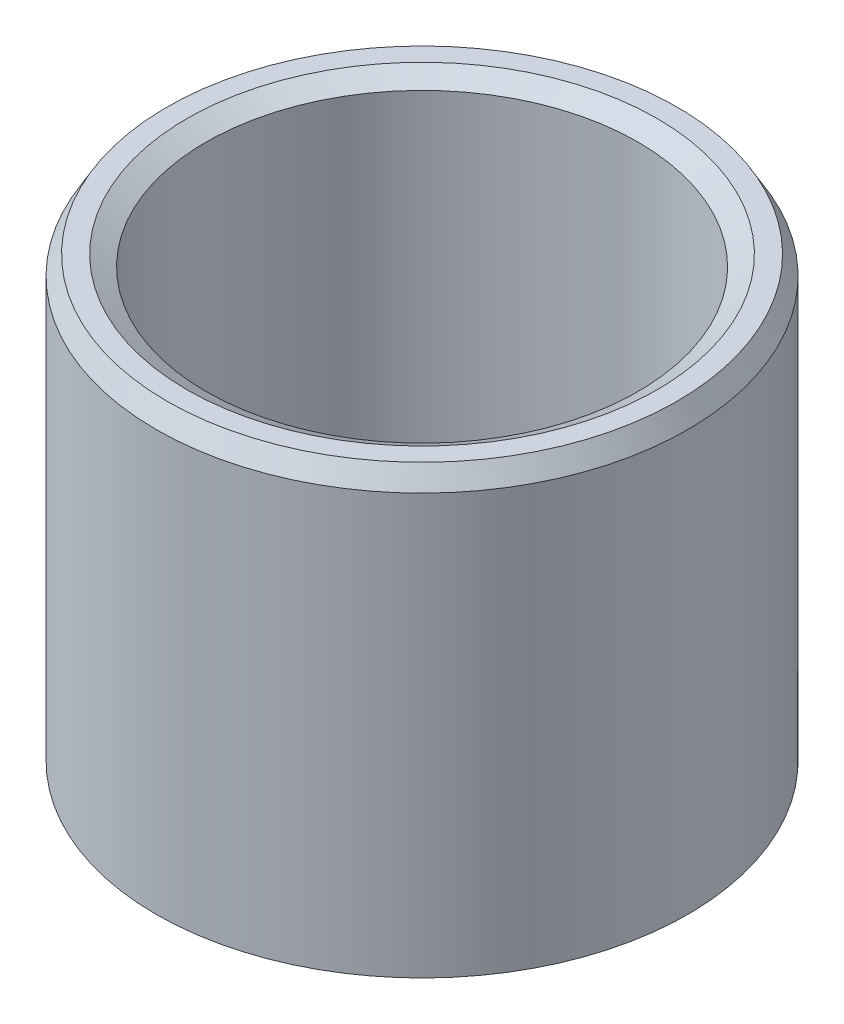
ISO-10303-21;
HEADER;
FILE_DESCRIPTION(('STEP AP214'),'2;1');
FILE_NAME('part.step','',(''),(''),'','','');
FILE_SCHEMA(('AUTOMOTIVE_DESIGN { 1 0 10303 214 1 1 1 1 }'));
ENDSEC;
DATA;
#1=APPLICATION_CONTEXT('core data for automotive mechanical design processes');
#2=APPLICATION_PROTOCOL_DEFINITION('international standard','automotive_design',2000,#1);
#3=PRODUCT_CONTEXT('',#1,'mechanical');
#4=PRODUCT('Part','Part','',(#3));
#5=PRODUCT_RELATED_PRODUCT_CATEGORY('part','',(#4));
#6=PRODUCT_DEFINITION_FORMATION('','',#4);
#7=PRODUCT_DEFINITION_CONTEXT('part definition',#1,'design');
#8=PRODUCT_DEFINITION('design','',#6,#7);
#9=PRODUCT_DEFINITION_SHAPE('','',#8);
#10=(LENGTH_UNIT() NAMED_UNIT(*) SI_UNIT(.MILLI.,.METRE.));
#11=(NAMED_UNIT(*) PLANE_ANGLE_UNIT() SI_UNIT($,.RADIAN.));
#12=(NAMED_UNIT(*) SI_UNIT($,.STERADIAN.) SOLID_ANGLE_UNIT());
#13=UNCERTAINTY_MEASURE_WITH_UNIT(LENGTH_MEASURE(1.E-05),#10,'distance_accuracy_value','');
#14=(GEOMETRIC_REPRESENTATION_CONTEXT(3) GLOBAL_UNCERTAINTY_ASSIGNED_CONTEXT((#13)) GLOBAL_UNIT_ASSIGNED_CONTEXT((#10,
#11,#12)) REPRESENTATION_CONTEXT('',''));
#15=CARTESIAN_POINT('',(0.,0.,0.));
#16=DIRECTION('',(0.,0.,1.));
#17=DIRECTION('',(1.,0.,0.));
#18=AXIS2_PLACEMENT_3D('',#15,#16,#17);
#19=CARTESIAN_POINT('',(0.,25.3769514872629,0.));
#20=DIRECTION('',(0.,-1.,0.));
#21=DIRECTION('',(0.,0.,-1.));
#22=AXIS2_PLACEMENT_3D('',#19,#20,#21);
#23=CYLINDRICAL_SURFACE('',#22,15.);
#24=CARTESIAN_POINT('',(0.,0.617991661496481,0.));
#25=DIRECTION('',(0.,1.,0.));
#26=DIRECTION('',(0.,0.,1.));
#27=AXIS2_PLACEMENT_3D('',#24,#25,#26);
#28=CIRCLE('',#27,15.);
#29=CARTESIAN_POINT('',(0.,0.617991661496481,15.));
#30=VERTEX_POINT('',#29);
#31=EDGE_CURVE('E10',#30,#30,#28,.T.);
#32=ORIENTED_EDGE('',*,*,#31,.T.);
#33=EDGE_LOOP('',(#32));
#34=FACE_BOUND('',#33,.T.);
#35=CARTESIAN_POINT('',(0.,24.3065585308971,0.));
#36=DIRECTION('',(0.,1.,0.));
#37=DIRECTION('',(0.,0.,1.));
#38=AXIS2_PLACEMENT_3D('',#35,#36,#37);
#39=CIRCLE('',#38,15.);
#40=CARTESIAN_POINT('',(0.,24.3065585308971,15.));
#41=VERTEX_POINT('',#40);
#42=EDGE_CURVE('E50',#41,#41,#39,.F.);
#43=ORIENTED_EDGE('',*,*,#42,.T.);
#44=EDGE_LOOP('',(#43));
#45=FACE_BOUND('',#44,.T.);
#46=ADVANCED_FACE('F39',(#34,#45),#23,.T.);
#47=CARTESIAN_POINT('',(0.,25.3769514872629,0.));
#48=DIRECTION('',(0.,1.,0.));
#49=DIRECTION('',(0.,0.,1.));
#50=AXIS2_PLACEMENT_3D('',#47,#48,#49);
#51=PLANE('',#50);
#52=CARTESIAN_POINT('',(0.,25.3769514872629,0.));
#53=DIRECTION('',(0.,1.,0.));
#54=DIRECTION('',(0.,0.,1.));
#55=AXIS2_PLACEMENT_3D('',#52,#53,#54);
#56=CIRCLE('',#55,13.2588330616108);
#57=CARTESIAN_POINT('',(0.,25.3769514872629,13.2588330616108));
#58=VERTEX_POINT('',#57);
#59=EDGE_CURVE('E58',#58,#58,#56,.F.);
#60=ORIENTED_EDGE('',*,*,#59,.T.);
#61=EDGE_LOOP('',(#60));
#62=FACE_BOUND('',#61,.T.);
#63=CARTESIAN_POINT('',(0.,25.3769514872629,0.));
#64=DIRECTION('',(0.,1.,0.));
#65=DIRECTION('',(0.,0.,1.));
#66=AXIS2_PLACEMENT_3D('',#63,#64,#65);
#67=CIRCLE('',#66,14.3820083385035);
#68=CARTESIAN_POINT('',(0.,25.3769514872629,14.3820083385035));
#69=VERTEX_POINT('',#68);
#70=EDGE_CURVE('E61',#69,#69,#67,.T.);
#71=ORIENTED_EDGE('',*,*,#70,.T.);
#72=EDGE_LOOP('',(#71));
#73=FACE_BOUND('',#72,.T.);
#74=ADVANCED_FACE('F88',(#62,#73),#51,.T.);
#75=CARTESIAN_POINT('',(0.,0.,0.));
#76=DIRECTION('',(0.,1.,0.));
#77=DIRECTION('',(0.,0.,1.));
#78=AXIS2_PLACEMENT_3D('',#75,#76,#77);
#79=PLANE('',#78);
#80=CARTESIAN_POINT('',(0.,0.,0.));
#81=DIRECTION('',(0.,1.,0.));
#82=DIRECTION('',(0.,0.,1.));
#83=AXIS2_PLACEMENT_3D('',#80,#81,#82);
#84=CIRCLE('',#83,12.8064317667415);
#85=CARTESIAN_POINT('',(0.,0.,12.8064317667415));
#86=VERTEX_POINT('',#85);
#87=EDGE_CURVE('E51',#86,#86,#84,.T.);
#88=ORIENTED_EDGE('',*,*,#87,.T.);
#89=EDGE_LOOP('',(#88));
#90=FACE_BOUND('',#89,.T.);
#91=CARTESIAN_POINT('',(0.,0.,0.));
#92=DIRECTION('',(0.,1.,0.));
#93=DIRECTION('',(0.,0.,1.));
#94=AXIS2_PLACEMENT_3D('',#91,#92,#93);
#95=CIRCLE('',#94,13.9296070436342);
#96=CARTESIAN_POINT('',(0.,0.,13.9296070436342));
#97=VERTEX_POINT('',#96);
#98=EDGE_CURVE('E54',#97,#97,#95,.F.);
#99=ORIENTED_EDGE('',*,*,#98,.T.);
#100=EDGE_LOOP('',(#99));
#101=FACE_BOUND('',#100,.T.);
#102=ADVANCED_FACE('F83',(#90,#101),#79,.F.);
#103=CARTESIAN_POINT('',(0.,25.3769514872629,0.));
#104=DIRECTION('',(0.,-1.,0.));
#105=DIRECTION('',(0.,0.,-1.));
#106=AXIS2_PLACEMENT_3D('',#103,#104,#105);
#107=CYLINDRICAL_SURFACE('',#106,12.188440105245);
#108=CARTESIAN_POINT('',(0.,24.7589598257664,0.));
#109=DIRECTION('',(0.,1.,0.));
#110=DIRECTION('',(0.,0.,1.));
#111=AXIS2_PLACEMENT_3D('',#108,#109,#110);
#112=CIRCLE('',#111,12.188440105245);
#113=CARTESIAN_POINT('',(0.,24.7589598257664,12.188440105245));
#114=VERTEX_POINT('',#113);
#115=EDGE_CURVE('E67',#114,#114,#112,.T.);
#116=ORIENTED_EDGE('',*,*,#115,.T.);
#117=EDGE_LOOP('',(#116));
#118=FACE_BOUND('',#117,.T.);
#119=CARTESIAN_POINT('',(0.,1.07039295636583,0.));
#120=DIRECTION('',(0.,1.,0.));
#121=DIRECTION('',(0.,0.,1.));
#122=AXIS2_PLACEMENT_3D('',#119,#120,#121);
#123=CIRCLE('',#122,12.188440105245);
#124=CARTESIAN_POINT('',(0.,1.07039295636583,12.188440105245));
#125=VERTEX_POINT('',#124);
#126=EDGE_CURVE('E69',#125,#125,#123,.F.);
#127=ORIENTED_EDGE('',*,*,#126,.T.);
#128=EDGE_LOOP('',(#127));
#129=FACE_BOUND('',#128,.T.);
#130=ADVANCED_FACE('F71',(#118,#129),#107,.F.);
#131=CARTESIAN_POINT('',(0.,24.7589598257664,0.));
#132=DIRECTION('',(0.,1.,0.));
#133=DIRECTION('',(0.,0.,1.));
#134=AXIS2_PLACEMENT_3D('',#131,#132,#133);
#135=CONICAL_SURFACE('',#134,12.188440105245,1.0471975511966);
#136=ORIENTED_EDGE('',*,*,#59,.F.);
#137=EDGE_LOOP('',(#136));
#138=FACE_BOUND('',#137,.T.);
#139=ORIENTED_EDGE('',*,*,#115,.F.);
#140=EDGE_LOOP('',(#139));
#141=FACE_BOUND('',#140,.T.);
#142=ADVANCED_FACE('F77',(#138,#141),#135,.F.);
#143=CARTESIAN_POINT('',(0.,0.,0.));
#144=DIRECTION('',(0.,-1.,0.));
#145=DIRECTION('',(0.,0.,-1.));
#146=AXIS2_PLACEMENT_3D('',#143,#144,#145);
#147=CONICAL_SURFACE('',#146,12.8064317667415,0.523598775598298);
#148=ORIENTED_EDGE('',*,*,#126,.F.);
#149=EDGE_LOOP('',(#148));
#150=FACE_BOUND('',#149,.T.);
#151=ORIENTED_EDGE('',*,*,#87,.F.);
#152=EDGE_LOOP('',(#151));
#153=FACE_BOUND('',#152,.T.);
#154=ADVANCED_FACE('F73',(#150,#153),#147,.F.);
#155=CARTESIAN_POINT('',(0.,0.617991661496481,0.));
#156=DIRECTION('',(0.,1.,0.));
#157=DIRECTION('',(0.,0.,1.));
#158=AXIS2_PLACEMENT_3D('',#155,#156,#157);
#159=CONICAL_SURFACE('',#158,15.,1.0471975511966);
#160=ORIENTED_EDGE('',*,*,#98,.F.);
#161=EDGE_LOOP('',(#160));
#162=FACE_BOUND('',#161,.T.);
#163=ORIENTED_EDGE('',*,*,#31,.F.);
#164=EDGE_LOOP('',(#163));
#165=FACE_BOUND('',#164,.T.);
#166=ADVANCED_FACE('F76',(#162,#165),#159,.T.);
#167=CARTESIAN_POINT('',(0.,25.3769514872629,0.));
#168=DIRECTION('',(0.,-1.,0.));
#169=DIRECTION('',(0.,0.,-1.));
#170=AXIS2_PLACEMENT_3D('',#167,#168,#169);
#171=CONICAL_SURFACE('',#170,14.3820083385035,0.523598775598295);
#172=ORIENTED_EDGE('',*,*,#42,.F.);
#173=EDGE_LOOP('',(#172));
#174=FACE_BOUND('',#173,.T.);
#175=ORIENTED_EDGE('',*,*,#70,.F.);
#176=EDGE_LOOP('',(#175));
#177=FACE_BOUND('',#176,.T.);
#178=ADVANCED_FACE('F45',(#174,#177),#171,.T.);
#179=CLOSED_SHELL('',(#46,#74,#102,#130,#142,#154,#166,#178));
#180=MANIFOLD_SOLID_BREP('B2',#179);
#181=ADVANCED_BREP_SHAPE_REPRESENTATION('',(#18,#180),#14);
#182=SHAPE_DEFINITION_REPRESENTATION(#9,#181);
ENDSEC;
END-ISO-10303-21;
